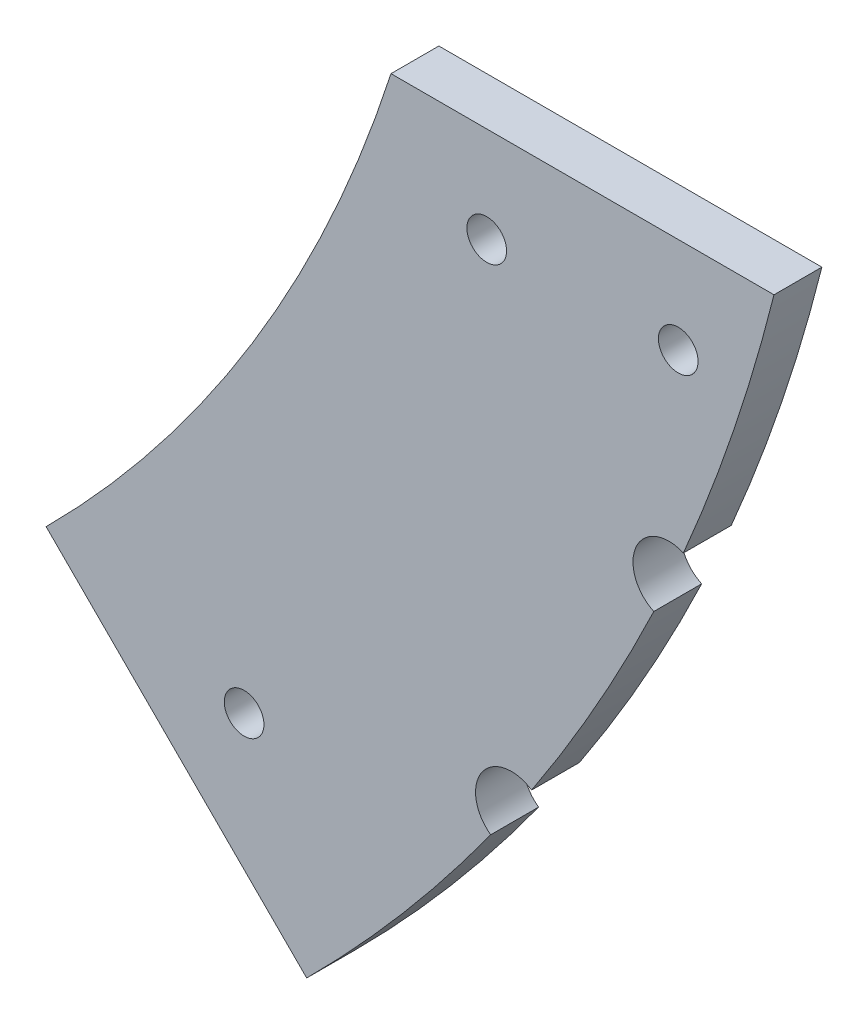
ISO-10303-21;
HEADER;
FILE_DESCRIPTION(('STEP AP214'),'2;1');
FILE_NAME('part.step','',(''),(''),'','','');
FILE_SCHEMA(('AUTOMOTIVE_DESIGN { 1 0 10303 214 1 1 1 1 }'));
ENDSEC;
DATA;
#1=APPLICATION_CONTEXT('core data for automotive mechanical design processes');
#2=APPLICATION_PROTOCOL_DEFINITION('international standard','automotive_design',2000,#1);
#3=PRODUCT_CONTEXT('',#1,'mechanical');
#4=PRODUCT('Part','Part','',(#3));
#5=PRODUCT_RELATED_PRODUCT_CATEGORY('part','',(#4));
#6=PRODUCT_DEFINITION_FORMATION('','',#4);
#7=PRODUCT_DEFINITION_CONTEXT('part definition',#1,'design');
#8=PRODUCT_DEFINITION('design','',#6,#7);
#9=PRODUCT_DEFINITION_SHAPE('','',#8);
#10=(LENGTH_UNIT() NAMED_UNIT(*) SI_UNIT(.MILLI.,.METRE.));
#11=(NAMED_UNIT(*) PLANE_ANGLE_UNIT() SI_UNIT($,.RADIAN.));
#12=(NAMED_UNIT(*) SI_UNIT($,.STERADIAN.) SOLID_ANGLE_UNIT());
#13=UNCERTAINTY_MEASURE_WITH_UNIT(LENGTH_MEASURE(1.E-05),#10,'distance_accuracy_value','');
#14=(GEOMETRIC_REPRESENTATION_CONTEXT(3) GLOBAL_UNCERTAINTY_ASSIGNED_CONTEXT((#13)) GLOBAL_UNIT_ASSIGNED_CONTEXT((#10,
#11,#12)) REPRESENTATION_CONTEXT('',''));
#15=CARTESIAN_POINT('',(0.,0.,0.));
#16=DIRECTION('',(0.,0.,1.));
#17=DIRECTION('',(1.,0.,0.));
#18=AXIS2_PLACEMENT_3D('',#15,#16,#17);
#19=CARTESIAN_POINT('',(0.,0.,6.35));
#20=DIRECTION('',(0.,0.,-1.));
#21=DIRECTION('',(-1.,0.,0.));
#22=AXIS2_PLACEMENT_3D('',#19,#20,#21);
#23=CYLINDRICAL_SURFACE('',#22,235.635486504049);
#24=CARTESIAN_POINT('',(0.,0.,0.));
#25=DIRECTION('',(0.,0.,1.));
#26=DIRECTION('',(-1.,0.,0.));
#27=AXIS2_PLACEMENT_3D('',#24,#25,#26);
#28=CIRCLE('',#27,235.635486504049);
#29=CARTESIAN_POINT('',(166.619450395204,-166.619450395205,0.));
#30=VERTEX_POINT('',#29);
#31=CARTESIAN_POINT('',(191.026872646986,-137.959473856318,0.));
#32=VERTEX_POINT('',#31);
#33=EDGE_CURVE('E144',#30,#32,#28,.T.);
#34=ORIENTED_EDGE('',*,*,#33,.T.);
#35=DIRECTION('',(0.,0.,1.));
#36=VECTOR('',#35,1.);
#37=CARTESIAN_POINT('',(191.026872646986,-137.959473856318,3.175));
#38=LINE('',#37,#36);
#39=CARTESIAN_POINT('',(191.026872646986,-137.959473856318,6.35));
#40=VERTEX_POINT('',#39);
#41=EDGE_CURVE('E11',#32,#40,#38,.T.);
#42=ORIENTED_EDGE('',*,*,#41,.T.);
#43=CARTESIAN_POINT('',(0.,0.,6.35));
#44=DIRECTION('',(0.,0.,1.));
#45=DIRECTION('',(-1.,0.,0.));
#46=AXIS2_PLACEMENT_3D('',#43,#44,#45);
#47=CIRCLE('',#46,235.635486504049);
#48=CARTESIAN_POINT('',(166.619450395204,-166.619450395205,6.35));
#49=VERTEX_POINT('',#48);
#50=EDGE_CURVE('E125',#49,#40,#47,.T.);
#51=ORIENTED_EDGE('',*,*,#50,.F.);
#52=DIRECTION('',(0.,0.,-1.));
#53=VECTOR('',#52,1.);
#54=CARTESIAN_POINT('',(166.619450395204,-166.619450395205,6.35));
#55=LINE('',#54,#53);
#56=EDGE_CURVE('E151',#49,#30,#55,.T.);
#57=ORIENTED_EDGE('',*,*,#56,.T.);
#58=EDGE_LOOP('',(#34,#42,#51,#57));
#59=FACE_BOUND('',#58,.T.);
#60=ADVANCED_FACE('F35',(#59),#23,.T.);
#61=CARTESIAN_POINT('',(196.446078348296,-130.126941105888,6.35));
#62=VERTEX_POINT('',#61);
#63=CARTESIAN_POINT('',(212.653604923493,-101.501363601889,6.35));
#64=VERTEX_POINT('',#63);
#65=EDGE_CURVE('E117',#62,#64,#47,.T.);
#66=ORIENTED_EDGE('',*,*,#65,.F.);
#67=DIRECTION('',(0.,0.,1.));
#68=VECTOR('',#67,1.);
#69=CARTESIAN_POINT('',(196.446078348296,-130.126941105888,3.175));
#70=LINE('',#69,#68);
#71=CARTESIAN_POINT('',(196.446078348296,-130.126941105888,0.));
#72=VERTEX_POINT('',#71);
#73=EDGE_CURVE('E43',#62,#72,#70,.F.);
#74=ORIENTED_EDGE('',*,*,#73,.T.);
#75=CARTESIAN_POINT('',(212.653604923493,-101.501363601889,0.));
#76=VERTEX_POINT('',#75);
#77=EDGE_CURVE('E148',#72,#76,#28,.T.);
#78=ORIENTED_EDGE('',*,*,#77,.T.);
#79=DIRECTION('',(0.,0.,1.));
#80=VECTOR('',#79,1.);
#81=CARTESIAN_POINT('',(212.653604923493,-101.501363601889,3.175));
#82=LINE('',#81,#80);
#83=EDGE_CURVE('E105',#76,#64,#82,.T.);
#84=ORIENTED_EDGE('',*,*,#83,.T.);
#85=EDGE_LOOP('',(#66,#74,#78,#84));
#86=FACE_BOUND('',#85,.T.);
#87=ADVANCED_FACE('F159',(#86),#23,.T.);
#88=CARTESIAN_POINT('',(0.,0.,6.35));
#89=DIRECTION('',(0.,0.,-1.));
#90=DIRECTION('',(-1.,0.,0.));
#91=AXIS2_PLACEMENT_3D('',#88,#89,#90);
#92=PLANE('',#91);
#93=ORIENTED_EDGE('',*,*,#50,.T.);
#94=CARTESIAN_POINT('',(193.776053940031,-134.070591180282,6.35));
#95=DIRECTION('',(0.,0.,1.));
#96=DIRECTION('',(1.,0.,0.));
#97=AXIS2_PLACEMENT_3D('',#94,#95,#96);
#98=CIRCLE('',#97,4.76250000000001);
#99=EDGE_CURVE('E191',#62,#40,#98,.T.);
#100=ORIENTED_EDGE('',*,*,#99,.F.);
#101=ORIENTED_EDGE('',*,*,#65,.T.);
#102=CARTESIAN_POINT('',(214.661540738831,-97.182845336155,6.35));
#103=DIRECTION('',(0.,0.,1.));
#104=DIRECTION('',(1.,0.,0.));
#105=AXIS2_PLACEMENT_3D('',#102,#103,#104);
#106=CIRCLE('',#105,4.76250000000001);
#107=CARTESIAN_POINT('',(216.581788016286,-92.8246281956918,6.35));
#108=VERTEX_POINT('',#107);
#109=EDGE_CURVE('E100',#108,#64,#106,.T.);
#110=ORIENTED_EDGE('',*,*,#109,.F.);
#111=CARTESIAN_POINT('',(228.6,-57.15,6.35));
#112=VERTEX_POINT('',#111);
#113=EDGE_CURVE('E113',#108,#112,#47,.T.);
#114=ORIENTED_EDGE('',*,*,#113,.T.);
#115=DIRECTION('',(-1.,0.,0.));
#116=VECTOR('',#115,1.);
#117=CARTESIAN_POINT('',(177.8,-57.15,6.35));
#118=LINE('',#117,#116);
#119=CARTESIAN_POINT('',(177.8,-57.15,6.35));
#120=VERTEX_POINT('',#119);
#121=EDGE_CURVE('E129',#112,#120,#118,.T.);
#122=ORIENTED_EDGE('',*,*,#121,.T.);
#123=CARTESIAN_POINT('',(0.,0.,6.35));
#124=DIRECTION('',(0.,0.,-1.));
#125=DIRECTION('',(-1.,0.,0.));
#126=AXIS2_PLACEMENT_3D('',#123,#124,#125);
#127=CIRCLE('',#126,186.75910285713);
#128=CARTESIAN_POINT('',(132.058628078592,-132.058628078593,6.35));
#129=VERTEX_POINT('',#128);
#130=EDGE_CURVE('E126',#120,#129,#127,.T.);
#131=ORIENTED_EDGE('',*,*,#130,.T.);
#132=DIRECTION('',(0.707106781186546,-0.707106781186549,0.));
#133=VECTOR('',#132,1.);
#134=CARTESIAN_POINT('',(132.058628078592,-132.058628078593,6.35));
#135=LINE('',#134,#133);
#136=EDGE_CURVE('E123',#129,#49,#135,.T.);
#137=ORIENTED_EDGE('',*,*,#136,.T.);
#138=EDGE_LOOP('',(#93,#100,#101,#110,#114,#122,#131,#137));
#139=FACE_BOUND('',#138,.T.);
#140=CARTESIAN_POINT('',(190.5,-69.85,6.35));
#141=DIRECTION('',(0.,0.,1.));
#142=DIRECTION('',(1.,0.,0.));
#143=AXIS2_PLACEMENT_3D('',#140,#141,#142);
#144=CIRCLE('',#143,2.62889999999999);
#145=CARTESIAN_POINT('',(193.1289,-69.85,6.35));
#146=VERTEX_POINT('',#145);
#147=EDGE_CURVE('E141',#146,#146,#144,.T.);
#148=ORIENTED_EDGE('',*,*,#147,.F.);
#149=EDGE_LOOP('',(#148));
#150=FACE_BOUND('',#149,.T.);
#151=CARTESIAN_POINT('',(215.9,-69.85,6.35));
#152=DIRECTION('',(0.,0.,1.));
#153=DIRECTION('',(1.,0.,0.));
#154=AXIS2_PLACEMENT_3D('',#151,#152,#153);
#155=CIRCLE('',#154,2.62889999999999);
#156=CARTESIAN_POINT('',(218.5289,-69.85,6.35));
#157=VERTEX_POINT('',#156);
#158=EDGE_CURVE('E176',#157,#157,#155,.T.);
#159=ORIENTED_EDGE('',*,*,#158,.F.);
#160=EDGE_LOOP('',(#159));
#161=FACE_BOUND('',#160,.T.);
#162=CARTESIAN_POINT('',(158.319295357967,-140.35878311583,6.35));
#163=DIRECTION('',(0.,0.,1.));
#164=DIRECTION('',(1.,0.,0.));
#165=AXIS2_PLACEMENT_3D('',#162,#163,#164);
#166=CIRCLE('',#165,2.62889999999999);
#167=CARTESIAN_POINT('',(160.948195357967,-140.35878311583,6.35));
#168=VERTEX_POINT('',#167);
#169=EDGE_CURVE('E182',#168,#168,#166,.T.);
#170=ORIENTED_EDGE('',*,*,#169,.F.);
#171=EDGE_LOOP('',(#170));
#172=FACE_BOUND('',#171,.T.);
#173=ADVANCED_FACE('F111',(#139,#150,#161,#172),#92,.F.);
#174=CARTESIAN_POINT('',(0.,0.,0.));
#175=DIRECTION('',(0.,0.,-1.));
#176=DIRECTION('',(-1.,0.,0.));
#177=AXIS2_PLACEMENT_3D('',#174,#175,#176);
#178=PLANE('',#177);
#179=CARTESIAN_POINT('',(193.776053940031,-134.070591180282,0.));
#180=DIRECTION('',(0.,0.,1.));
#181=DIRECTION('',(1.,0.,0.));
#182=AXIS2_PLACEMENT_3D('',#179,#180,#181);
#183=CIRCLE('',#182,4.76250000000001);
#184=EDGE_CURVE('E58',#72,#32,#183,.T.);
#185=ORIENTED_EDGE('',*,*,#184,.T.);
#186=ORIENTED_EDGE('',*,*,#33,.F.);
#187=DIRECTION('',(0.707106781186546,-0.707106781186549,0.));
#188=VECTOR('',#187,1.);
#189=CARTESIAN_POINT('',(132.058628078592,-132.058628078593,0.));
#190=LINE('',#189,#188);
#191=CARTESIAN_POINT('',(132.058628078592,-132.058628078593,0.));
#192=VERTEX_POINT('',#191);
#193=EDGE_CURVE('E140',#192,#30,#190,.T.);
#194=ORIENTED_EDGE('',*,*,#193,.F.);
#195=CARTESIAN_POINT('',(0.,0.,0.));
#196=DIRECTION('',(0.,0.,-1.));
#197=DIRECTION('',(-1.,0.,0.));
#198=AXIS2_PLACEMENT_3D('',#195,#196,#197);
#199=CIRCLE('',#198,186.75910285713);
#200=CARTESIAN_POINT('',(177.8,-57.15,0.));
#201=VERTEX_POINT('',#200);
#202=EDGE_CURVE('E137',#201,#192,#199,.T.);
#203=ORIENTED_EDGE('',*,*,#202,.F.);
#204=DIRECTION('',(-1.,0.,0.));
#205=VECTOR('',#204,1.);
#206=CARTESIAN_POINT('',(177.8,-57.15,0.));
#207=LINE('',#206,#205);
#208=CARTESIAN_POINT('',(228.6,-57.15,0.));
#209=VERTEX_POINT('',#208);
#210=EDGE_CURVE('E147',#209,#201,#207,.T.);
#211=ORIENTED_EDGE('',*,*,#210,.F.);
#212=CARTESIAN_POINT('',(216.581788016286,-92.8246281956918,0.));
#213=VERTEX_POINT('',#212);
#214=EDGE_CURVE('E143',#213,#209,#28,.T.);
#215=ORIENTED_EDGE('',*,*,#214,.F.);
#216=CARTESIAN_POINT('',(214.661540738831,-97.182845336155,0.));
#217=DIRECTION('',(0.,0.,1.));
#218=DIRECTION('',(1.,0.,0.));
#219=AXIS2_PLACEMENT_3D('',#216,#217,#218);
#220=CIRCLE('',#219,4.76250000000001);
#221=EDGE_CURVE('E50',#213,#76,#220,.T.);
#222=ORIENTED_EDGE('',*,*,#221,.T.);
#223=ORIENTED_EDGE('',*,*,#77,.F.);
#224=EDGE_LOOP('',(#185,#186,#194,#203,#211,#215,#222,#223));
#225=FACE_BOUND('',#224,.T.);
#226=CARTESIAN_POINT('',(215.9,-69.85,0.));
#227=DIRECTION('',(0.,0.,1.));
#228=DIRECTION('',(1.,0.,0.));
#229=AXIS2_PLACEMENT_3D('',#226,#227,#228);
#230=CIRCLE('',#229,2.62889999999999);
#231=CARTESIAN_POINT('',(218.5289,-69.85,0.));
#232=VERTEX_POINT('',#231);
#233=EDGE_CURVE('E179',#232,#232,#230,.T.);
#234=ORIENTED_EDGE('',*,*,#233,.T.);
#235=EDGE_LOOP('',(#234));
#236=FACE_BOUND('',#235,.T.);
#237=CARTESIAN_POINT('',(190.5,-69.85,0.));
#238=DIRECTION('',(0.,0.,1.));
#239=DIRECTION('',(1.,0.,0.));
#240=AXIS2_PLACEMENT_3D('',#237,#238,#239);
#241=CIRCLE('',#240,2.62889999999999);
#242=CARTESIAN_POINT('',(193.1289,-69.85,0.));
#243=VERTEX_POINT('',#242);
#244=EDGE_CURVE('E173',#243,#243,#241,.T.);
#245=ORIENTED_EDGE('',*,*,#244,.T.);
#246=EDGE_LOOP('',(#245));
#247=FACE_BOUND('',#246,.T.);
#248=CARTESIAN_POINT('',(158.319295357967,-140.35878311583,0.));
#249=DIRECTION('',(0.,0.,1.));
#250=DIRECTION('',(1.,0.,0.));
#251=AXIS2_PLACEMENT_3D('',#248,#249,#250);
#252=CIRCLE('',#251,2.62889999999999);
#253=CARTESIAN_POINT('',(160.948195357967,-140.35878311583,0.));
#254=VERTEX_POINT('',#253);
#255=EDGE_CURVE('E185',#254,#254,#252,.T.);
#256=ORIENTED_EDGE('',*,*,#255,.T.);
#257=EDGE_LOOP('',(#256));
#258=FACE_BOUND('',#257,.T.);
#259=ADVANCED_FACE('F161',(#225,#236,#247,#258),#178,.T.);
#260=CARTESIAN_POINT('',(0.,0.,6.35));
#261=DIRECTION('',(0.,0.,-1.));
#262=DIRECTION('',(-1.,0.,0.));
#263=AXIS2_PLACEMENT_3D('',#260,#261,#262);
#264=CYLINDRICAL_SURFACE('',#263,186.75910285713);
#265=ORIENTED_EDGE('',*,*,#202,.T.);
#266=DIRECTION('',(0.,0.,-1.));
#267=VECTOR('',#266,1.);
#268=CARTESIAN_POINT('',(132.058628078592,-132.058628078593,6.35));
#269=LINE('',#268,#267);
#270=EDGE_CURVE('E106',#129,#192,#269,.T.);
#271=ORIENTED_EDGE('',*,*,#270,.F.);
#272=ORIENTED_EDGE('',*,*,#130,.F.);
#273=DIRECTION('',(0.,0.,-1.));
#274=VECTOR('',#273,1.);
#275=CARTESIAN_POINT('',(177.8,-57.15,6.35));
#276=LINE('',#275,#274);
#277=EDGE_CURVE('E131',#120,#201,#276,.T.);
#278=ORIENTED_EDGE('',*,*,#277,.T.);
#279=EDGE_LOOP('',(#265,#271,#272,#278));
#280=FACE_BOUND('',#279,.T.);
#281=ADVANCED_FACE('F37',(#280),#264,.F.);
#282=CARTESIAN_POINT('',(132.058628078592,-132.058628078593,6.35));
#283=DIRECTION('',(0.707106781186549,0.707106781186546,0.));
#284=DIRECTION('',(-0.707106781186546,0.707106781186549,0.));
#285=AXIS2_PLACEMENT_3D('',#282,#283,#284);
#286=PLANE('',#285);
#287=ORIENTED_EDGE('',*,*,#193,.T.);
#288=ORIENTED_EDGE('',*,*,#56,.F.);
#289=ORIENTED_EDGE('',*,*,#136,.F.);
#290=ORIENTED_EDGE('',*,*,#270,.T.);
#291=EDGE_LOOP('',(#287,#288,#289,#290));
#292=FACE_BOUND('',#291,.T.);
#293=ADVANCED_FACE('F197',(#292),#286,.F.);
#294=ORIENTED_EDGE('',*,*,#113,.F.);
#295=DIRECTION('',(0.,0.,1.));
#296=VECTOR('',#295,1.);
#297=CARTESIAN_POINT('',(216.581788016286,-92.8246281956918,3.175));
#298=LINE('',#297,#296);
#299=EDGE_CURVE('E97',#108,#213,#298,.F.);
#300=ORIENTED_EDGE('',*,*,#299,.T.);
#301=ORIENTED_EDGE('',*,*,#214,.T.);
#302=DIRECTION('',(0.,0.,-1.));
#303=VECTOR('',#302,1.);
#304=CARTESIAN_POINT('',(228.6,-57.15,6.35));
#305=LINE('',#304,#303);
#306=EDGE_CURVE('E121',#112,#209,#305,.T.);
#307=ORIENTED_EDGE('',*,*,#306,.F.);
#308=EDGE_LOOP('',(#294,#300,#301,#307));
#309=FACE_BOUND('',#308,.T.);
#310=ADVANCED_FACE('F119',(#309),#23,.T.);
#311=CARTESIAN_POINT('',(177.8,-57.15,6.35));
#312=DIRECTION('',(0.,-1.,0.));
#313=DIRECTION('',(0.,0.,-1.));
#314=AXIS2_PLACEMENT_3D('',#311,#312,#313);
#315=PLANE('',#314);
#316=ORIENTED_EDGE('',*,*,#210,.T.);
#317=ORIENTED_EDGE('',*,*,#277,.F.);
#318=ORIENTED_EDGE('',*,*,#121,.F.);
#319=ORIENTED_EDGE('',*,*,#306,.T.);
#320=EDGE_LOOP('',(#316,#317,#318,#319));
#321=FACE_BOUND('',#320,.T.);
#322=ADVANCED_FACE('F166',(#321),#315,.F.);
#323=CARTESIAN_POINT('',(190.5,-69.85,6.35));
#324=DIRECTION('',(0.,0.,-1.));
#325=DIRECTION('',(-1.,0.,0.));
#326=AXIS2_PLACEMENT_3D('',#323,#324,#325);
#327=CYLINDRICAL_SURFACE('',#326,2.62889999999999);
#328=ORIENTED_EDGE('',*,*,#147,.T.);
#329=EDGE_LOOP('',(#328));
#330=FACE_BOUND('',#329,.T.);
#331=ORIENTED_EDGE('',*,*,#244,.F.);
#332=EDGE_LOOP('',(#331));
#333=FACE_BOUND('',#332,.T.);
#334=ADVANCED_FACE('F211',(#330,#333),#327,.F.);
#335=CARTESIAN_POINT('',(215.9,-69.85,6.35));
#336=DIRECTION('',(0.,0.,-1.));
#337=DIRECTION('',(-1.,0.,0.));
#338=AXIS2_PLACEMENT_3D('',#335,#336,#337);
#339=CYLINDRICAL_SURFACE('',#338,2.62889999999999);
#340=ORIENTED_EDGE('',*,*,#158,.T.);
#341=EDGE_LOOP('',(#340));
#342=FACE_BOUND('',#341,.T.);
#343=ORIENTED_EDGE('',*,*,#233,.F.);
#344=EDGE_LOOP('',(#343));
#345=FACE_BOUND('',#344,.T.);
#346=ADVANCED_FACE('F218',(#342,#345),#339,.F.);
#347=CARTESIAN_POINT('',(158.319295357967,-140.35878311583,6.35));
#348=DIRECTION('',(0.,0.,-1.));
#349=DIRECTION('',(-1.,0.,0.));
#350=AXIS2_PLACEMENT_3D('',#347,#348,#349);
#351=CYLINDRICAL_SURFACE('',#350,2.62889999999999);
#352=ORIENTED_EDGE('',*,*,#169,.T.);
#353=EDGE_LOOP('',(#352));
#354=FACE_BOUND('',#353,.T.);
#355=ORIENTED_EDGE('',*,*,#255,.F.);
#356=EDGE_LOOP('',(#355));
#357=FACE_BOUND('',#356,.T.);
#358=ADVANCED_FACE('F222',(#354,#357),#351,.F.);
#359=CARTESIAN_POINT('',(214.661540738831,-97.182845336155,0.));
#360=DIRECTION('',(0.,0.,1.));
#361=DIRECTION('',(1.,0.,0.));
#362=AXIS2_PLACEMENT_3D('',#359,#360,#361);
#363=CYLINDRICAL_SURFACE('',#362,4.76250000000001);
#364=ORIENTED_EDGE('',*,*,#221,.F.);
#365=ORIENTED_EDGE('',*,*,#299,.F.);
#366=ORIENTED_EDGE('',*,*,#109,.T.);
#367=ORIENTED_EDGE('',*,*,#83,.F.);
#368=EDGE_LOOP('',(#364,#365,#366,#367));
#369=FACE_BOUND('',#368,.T.);
#370=ADVANCED_FACE('F99',(#369),#363,.F.);
#371=CARTESIAN_POINT('',(193.776053940031,-134.070591180282,0.));
#372=DIRECTION('',(0.,0.,1.));
#373=DIRECTION('',(1.,0.,0.));
#374=AXIS2_PLACEMENT_3D('',#371,#372,#373);
#375=CYLINDRICAL_SURFACE('',#374,4.76250000000001);
#376=ORIENTED_EDGE('',*,*,#184,.F.);
#377=ORIENTED_EDGE('',*,*,#73,.F.);
#378=ORIENTED_EDGE('',*,*,#99,.T.);
#379=ORIENTED_EDGE('',*,*,#41,.F.);
#380=EDGE_LOOP('',(#376,#377,#378,#379));
#381=FACE_BOUND('',#380,.T.);
#382=ADVANCED_FACE('F193',(#381),#375,.F.);
#383=CLOSED_SHELL('',(#60,#87,#173,#259,#281,#293,#310,#322,#334,#346,#358,#370,#382));
#384=MANIFOLD_SOLID_BREP('B2',#383);
#385=ADVANCED_BREP_SHAPE_REPRESENTATION('',(#18,#384),#14);
#386=SHAPE_DEFINITION_REPRESENTATION(#9,#385);
ENDSEC;
END-ISO-10303-21;
